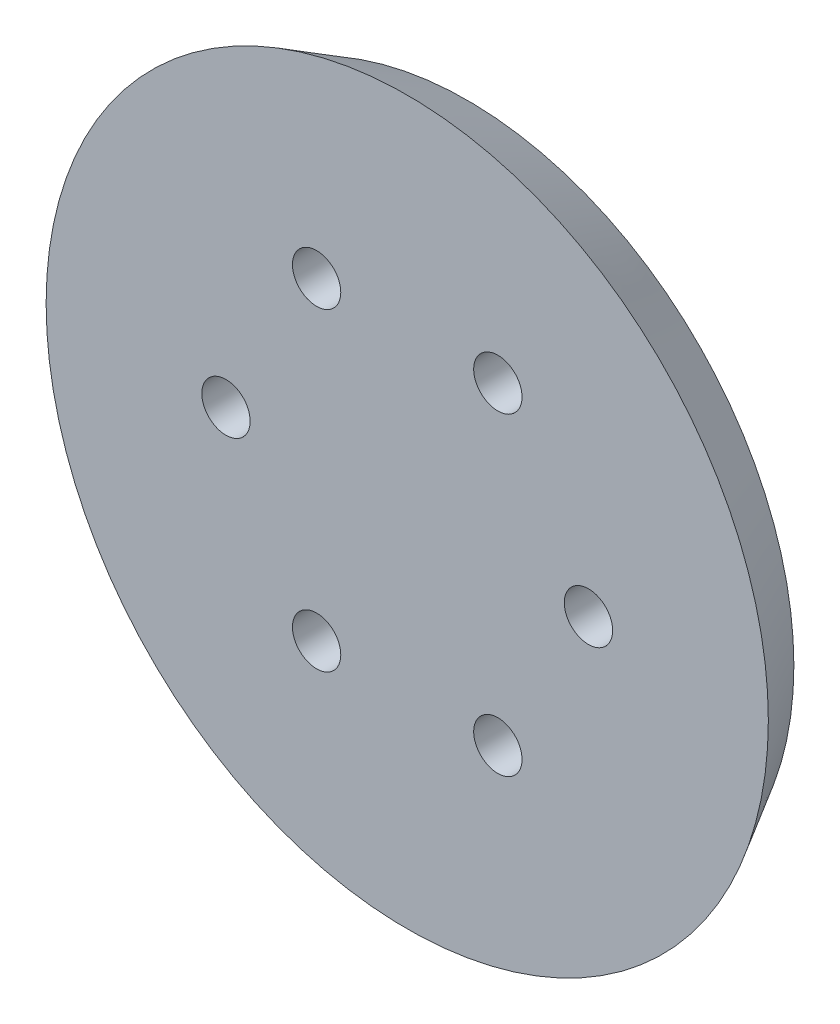
ISO-10303-21;
HEADER;
FILE_DESCRIPTION(('STEP AP214'),'2;1');
FILE_NAME('part.step','',(''),(''),'','','');
FILE_SCHEMA(('AUTOMOTIVE_DESIGN { 1 0 10303 214 1 1 1 1 }'));
ENDSEC;
DATA;
#1=APPLICATION_CONTEXT('core data for automotive mechanical design processes');
#2=APPLICATION_PROTOCOL_DEFINITION('international standard','automotive_design',2000,#1);
#3=PRODUCT_CONTEXT('',#1,'mechanical');
#4=PRODUCT('Part','Part','',(#3));
#5=PRODUCT_RELATED_PRODUCT_CATEGORY('part','',(#4));
#6=PRODUCT_DEFINITION_FORMATION('','',#4);
#7=PRODUCT_DEFINITION_CONTEXT('part definition',#1,'design');
#8=PRODUCT_DEFINITION('design','',#6,#7);
#9=PRODUCT_DEFINITION_SHAPE('','',#8);
#10=(LENGTH_UNIT() NAMED_UNIT(*) SI_UNIT(.MILLI.,.METRE.));
#11=(NAMED_UNIT(*) PLANE_ANGLE_UNIT() SI_UNIT($,.RADIAN.));
#12=(NAMED_UNIT(*) SI_UNIT($,.STERADIAN.) SOLID_ANGLE_UNIT());
#13=UNCERTAINTY_MEASURE_WITH_UNIT(LENGTH_MEASURE(1.E-05),#10,'distance_accuracy_value','');
#14=(GEOMETRIC_REPRESENTATION_CONTEXT(3) GLOBAL_UNCERTAINTY_ASSIGNED_CONTEXT((#13)) GLOBAL_UNIT_ASSIGNED_CONTEXT((#10,
#11,#12)) REPRESENTATION_CONTEXT('',''));
#15=CARTESIAN_POINT('',(0.,0.,0.));
#16=DIRECTION('',(0.,0.,1.));
#17=DIRECTION('',(1.,0.,0.));
#18=AXIS2_PLACEMENT_3D('',#15,#16,#17);
#19=CARTESIAN_POINT('',(0.,0.,-2.54));
#20=DIRECTION('',(0.,0.,-1.));
#21=DIRECTION('',(-1.,0.,0.));
#22=AXIS2_PLACEMENT_3D('',#19,#20,#21);
#23=PLANE('',#22);
#24=CARTESIAN_POINT('',(0.,0.,-2.54));
#25=DIRECTION('',(0.,0.,-1.));
#26=DIRECTION('',(-1.,0.,0.));
#27=AXIS2_PLACEMENT_3D('',#24,#25,#26);
#28=CIRCLE('',#27,5.08);
#29=CARTESIAN_POINT('',(-5.08,0.,-2.54));
#30=VERTEX_POINT('',#29);
#31=EDGE_CURVE('E83',#30,#30,#28,.T.);
#32=ORIENTED_EDGE('',*,*,#31,.T.);
#33=EDGE_LOOP('',(#32));
#34=FACE_BOUND('',#33,.T.);
#35=CARTESIAN_POINT('',(0.,0.,-2.54));
#36=DIRECTION('',(0.,0.,-1.));
#37=DIRECTION('',(-1.,0.,0.));
#38=AXIS2_PLACEMENT_3D('',#35,#36,#37);
#39=CIRCLE('',#38,4.064);
#40=CARTESIAN_POINT('',(-4.064,0.,-2.54));
#41=VERTEX_POINT('',#40);
#42=EDGE_CURVE('E89',#41,#41,#39,.T.);
#43=ORIENTED_EDGE('',*,*,#42,.F.);
#44=EDGE_LOOP('',(#43));
#45=FACE_BOUND('',#44,.T.);
#46=ADVANCED_FACE('F32',(#34,#45),#23,.T.);
#47=CARTESIAN_POINT('',(0.,0.,0.));
#48=DIRECTION('',(0.,0.,1.));
#49=DIRECTION('',(1.,0.,0.));
#50=AXIS2_PLACEMENT_3D('',#47,#48,#49);
#51=PLANE('',#50);
#52=CARTESIAN_POINT('',(19.0500000000004,32.9955678841869,0.));
#53=DIRECTION('',(0.,0.,1.));
#54=DIRECTION('',(1.,0.,0.));
#55=AXIS2_PLACEMENT_3D('',#52,#53,#54);
#56=CIRCLE('',#55,5.08);
#57=CARTESIAN_POINT('',(24.1300000000004,32.9955678841869,0.));
#58=VERTEX_POINT('',#57);
#59=EDGE_CURVE('E80',#58,#58,#56,.T.);
#60=ORIENTED_EDGE('',*,*,#59,.T.);
#61=EDGE_LOOP('',(#60));
#62=FACE_BOUND('',#61,.T.);
#63=CARTESIAN_POINT('',(-38.1,2.66050878019847E-13,0.));
#64=DIRECTION('',(0.,0.,1.));
#65=DIRECTION('',(1.,0.,0.));
#66=AXIS2_PLACEMENT_3D('',#63,#64,#65);
#67=CIRCLE('',#66,5.07999999999999);
#68=CARTESIAN_POINT('',(-33.02,2.66050878019847E-13,0.));
#69=VERTEX_POINT('',#68);
#70=EDGE_CURVE('E68',#69,#69,#67,.T.);
#71=ORIENTED_EDGE('',*,*,#70,.T.);
#72=EDGE_LOOP('',(#71));
#73=FACE_BOUND('',#72,.T.);
#74=CARTESIAN_POINT('',(19.0499999999999,-32.9955678841872,0.));
#75=DIRECTION('',(0.,0.,1.));
#76=DIRECTION('',(1.,0.,0.));
#77=AXIS2_PLACEMENT_3D('',#74,#75,#76);
#78=CIRCLE('',#77,5.08);
#79=CARTESIAN_POINT('',(24.1299999999999,-32.9955678841872,0.));
#80=VERTEX_POINT('',#79);
#81=EDGE_CURVE('E56',#80,#80,#78,.T.);
#82=ORIENTED_EDGE('',*,*,#81,.T.);
#83=EDGE_LOOP('',(#82));
#84=FACE_BOUND('',#83,.T.);
#85=CARTESIAN_POINT('',(38.1,0.,0.));
#86=DIRECTION('',(0.,0.,1.));
#87=DIRECTION('',(1.,0.,0.));
#88=AXIS2_PLACEMENT_3D('',#85,#86,#87);
#89=CIRCLE('',#88,5.08);
#90=CARTESIAN_POINT('',(43.18,0.,0.));
#91=VERTEX_POINT('',#90);
#92=EDGE_CURVE('E50',#91,#91,#89,.T.);
#93=ORIENTED_EDGE('',*,*,#92,.T.);
#94=EDGE_LOOP('',(#93));
#95=FACE_BOUND('',#94,.T.);
#96=CARTESIAN_POINT('',(-19.0500000000002,-32.995567884187,0.));
#97=DIRECTION('',(0.,0.,1.));
#98=DIRECTION('',(1.,0.,0.));
#99=AXIS2_PLACEMENT_3D('',#96,#97,#98);
#100=CIRCLE('',#99,5.08);
#101=CARTESIAN_POINT('',(-13.9700000000002,-32.995567884187,0.));
#102=VERTEX_POINT('',#101);
#103=EDGE_CURVE('E62',#102,#102,#100,.T.);
#104=ORIENTED_EDGE('',*,*,#103,.T.);
#105=EDGE_LOOP('',(#104));
#106=FACE_BOUND('',#105,.T.);
#107=CARTESIAN_POINT('',(-19.0499999999997,32.9955678841873,0.));
#108=DIRECTION('',(0.,0.,1.));
#109=DIRECTION('',(1.,0.,0.));
#110=AXIS2_PLACEMENT_3D('',#107,#108,#109);
#111=CIRCLE('',#110,5.08);
#112=CARTESIAN_POINT('',(-13.9699999999997,32.9955678841873,0.));
#113=VERTEX_POINT('',#112);
#114=EDGE_CURVE('E74',#113,#113,#111,.T.);
#115=ORIENTED_EDGE('',*,*,#114,.T.);
#116=EDGE_LOOP('',(#115));
#117=FACE_BOUND('',#116,.T.);
#118=CARTESIAN_POINT('',(0.,0.,0.));
#119=DIRECTION('',(0.,0.,1.));
#120=DIRECTION('',(1.,0.,0.));
#121=AXIS2_PLACEMENT_3D('',#118,#119,#120);
#122=CIRCLE('',#121,68.5799999999999);
#123=CARTESIAN_POINT('',(68.5799999999999,0.,0.));
#124=VERTEX_POINT('',#123);
#125=EDGE_CURVE('E39',#124,#124,#122,.F.);
#126=ORIENTED_EDGE('',*,*,#125,.T.);
#127=EDGE_LOOP('',(#126));
#128=FACE_BOUND('',#127,.T.);
#129=CARTESIAN_POINT('',(0.,0.,0.));
#130=DIRECTION('',(0.,0.,1.));
#131=DIRECTION('',(1.,0.,0.));
#132=AXIS2_PLACEMENT_3D('',#129,#130,#131);
#133=CIRCLE('',#132,5.08);
#134=CARTESIAN_POINT('',(5.08,0.,0.));
#135=VERTEX_POINT('',#134);
#136=EDGE_CURVE('E10',#135,#135,#133,.F.);
#137=ORIENTED_EDGE('',*,*,#136,.F.);
#138=EDGE_LOOP('',(#137));
#139=FACE_BOUND('',#138,.T.);
#140=ADVANCED_FACE('F123',(#62,#73,#84,#95,#106,#117,#128,#139),#51,.F.);
#141=CARTESIAN_POINT('',(0.,0.,12.7));
#142=DIRECTION('',(0.,0.,1.));
#143=DIRECTION('',(1.,0.,0.));
#144=AXIS2_PLACEMENT_3D('',#141,#142,#143);
#145=PLANE('',#144);
#146=CARTESIAN_POINT('',(0.,0.,12.7));
#147=DIRECTION('',(0.,0.,1.));
#148=DIRECTION('',(1.,0.,0.));
#149=AXIS2_PLACEMENT_3D('',#146,#147,#148);
#150=CIRCLE('',#149,75.9123484187081);
#151=CARTESIAN_POINT('',(75.9123484187081,0.,12.7));
#152=VERTEX_POINT('',#151);
#153=EDGE_CURVE('E43',#152,#152,#150,.T.);
#154=ORIENTED_EDGE('',*,*,#153,.T.);
#155=EDGE_LOOP('',(#154));
#156=FACE_BOUND('',#155,.T.);
#157=CARTESIAN_POINT('',(-19.0499999999997,32.9955678841873,12.7));
#158=DIRECTION('',(0.,0.,1.));
#159=DIRECTION('',(1.,0.,0.));
#160=AXIS2_PLACEMENT_3D('',#157,#158,#159);
#161=CIRCLE('',#160,5.08);
#162=CARTESIAN_POINT('',(-13.9699999999997,32.9955678841873,12.7));
#163=VERTEX_POINT('',#162);
#164=EDGE_CURVE('E71',#163,#163,#161,.T.);
#165=ORIENTED_EDGE('',*,*,#164,.F.);
#166=EDGE_LOOP('',(#165));
#167=FACE_BOUND('',#166,.T.);
#168=CARTESIAN_POINT('',(-19.0500000000002,-32.995567884187,12.7));
#169=DIRECTION('',(0.,0.,1.));
#170=DIRECTION('',(1.,0.,0.));
#171=AXIS2_PLACEMENT_3D('',#168,#169,#170);
#172=CIRCLE('',#171,5.08);
#173=CARTESIAN_POINT('',(-13.9700000000002,-32.995567884187,12.7));
#174=VERTEX_POINT('',#173);
#175=EDGE_CURVE('E59',#174,#174,#172,.T.);
#176=ORIENTED_EDGE('',*,*,#175,.F.);
#177=EDGE_LOOP('',(#176));
#178=FACE_BOUND('',#177,.T.);
#179=CARTESIAN_POINT('',(38.1,0.,12.7));
#180=DIRECTION('',(0.,0.,1.));
#181=DIRECTION('',(1.,0.,0.));
#182=AXIS2_PLACEMENT_3D('',#179,#180,#181);
#183=CIRCLE('',#182,5.08);
#184=CARTESIAN_POINT('',(43.18,0.,12.7));
#185=VERTEX_POINT('',#184);
#186=EDGE_CURVE('E47',#185,#185,#183,.T.);
#187=ORIENTED_EDGE('',*,*,#186,.F.);
#188=EDGE_LOOP('',(#187));
#189=FACE_BOUND('',#188,.T.);
#190=CARTESIAN_POINT('',(19.0499999999999,-32.9955678841872,12.7));
#191=DIRECTION('',(0.,0.,1.));
#192=DIRECTION('',(1.,0.,0.));
#193=AXIS2_PLACEMENT_3D('',#190,#191,#192);
#194=CIRCLE('',#193,5.08);
#195=CARTESIAN_POINT('',(24.1299999999999,-32.9955678841872,12.7));
#196=VERTEX_POINT('',#195);
#197=EDGE_CURVE('E53',#196,#196,#194,.T.);
#198=ORIENTED_EDGE('',*,*,#197,.F.);
#199=EDGE_LOOP('',(#198));
#200=FACE_BOUND('',#199,.T.);
#201=CARTESIAN_POINT('',(-38.1,2.66050878019847E-13,12.7));
#202=DIRECTION('',(0.,0.,1.));
#203=DIRECTION('',(1.,0.,0.));
#204=AXIS2_PLACEMENT_3D('',#201,#202,#203);
#205=CIRCLE('',#204,5.07999999999999);
#206=CARTESIAN_POINT('',(-33.02,2.66050878019847E-13,12.7));
#207=VERTEX_POINT('',#206);
#208=EDGE_CURVE('E65',#207,#207,#205,.T.);
#209=ORIENTED_EDGE('',*,*,#208,.F.);
#210=EDGE_LOOP('',(#209));
#211=FACE_BOUND('',#210,.T.);
#212=CARTESIAN_POINT('',(19.0500000000004,32.9955678841869,12.7));
#213=DIRECTION('',(0.,0.,1.));
#214=DIRECTION('',(1.,0.,0.));
#215=AXIS2_PLACEMENT_3D('',#212,#213,#214);
#216=CIRCLE('',#215,5.08);
#217=CARTESIAN_POINT('',(24.1300000000004,32.9955678841869,12.7));
#218=VERTEX_POINT('',#217);
#219=EDGE_CURVE('E77',#218,#218,#216,.T.);
#220=ORIENTED_EDGE('',*,*,#219,.F.);
#221=EDGE_LOOP('',(#220));
#222=FACE_BOUND('',#221,.T.);
#223=ADVANCED_FACE('F129',(#156,#167,#178,#189,#200,#211,#222),#145,.T.);
#224=CARTESIAN_POINT('',(38.1,0.,12.7));
#225=DIRECTION('',(0.,0.,-1.));
#226=DIRECTION('',(-1.,0.,0.));
#227=AXIS2_PLACEMENT_3D('',#224,#225,#226);
#228=CYLINDRICAL_SURFACE('',#227,5.08);
#229=ORIENTED_EDGE('',*,*,#186,.T.);
#230=EDGE_LOOP('',(#229));
#231=FACE_BOUND('',#230,.T.);
#232=ORIENTED_EDGE('',*,*,#92,.F.);
#233=EDGE_LOOP('',(#232));
#234=FACE_BOUND('',#233,.T.);
#235=ADVANCED_FACE('F154',(#231,#234),#228,.F.);
#236=CARTESIAN_POINT('',(19.0499999999999,-32.9955678841872,12.7));
#237=DIRECTION('',(0.,0.,-1.));
#238=DIRECTION('',(-1.,0.,0.));
#239=AXIS2_PLACEMENT_3D('',#236,#237,#238);
#240=CYLINDRICAL_SURFACE('',#239,5.08);
#241=ORIENTED_EDGE('',*,*,#197,.T.);
#242=EDGE_LOOP('',(#241));
#243=FACE_BOUND('',#242,.T.);
#244=ORIENTED_EDGE('',*,*,#81,.F.);
#245=EDGE_LOOP('',(#244));
#246=FACE_BOUND('',#245,.T.);
#247=ADVANCED_FACE('F150',(#243,#246),#240,.F.);
#248=CARTESIAN_POINT('',(-19.0500000000002,-32.995567884187,12.7));
#249=DIRECTION('',(0.,0.,-1.));
#250=DIRECTION('',(-1.,0.,0.));
#251=AXIS2_PLACEMENT_3D('',#248,#249,#250);
#252=CYLINDRICAL_SURFACE('',#251,5.08);
#253=ORIENTED_EDGE('',*,*,#175,.T.);
#254=EDGE_LOOP('',(#253));
#255=FACE_BOUND('',#254,.T.);
#256=ORIENTED_EDGE('',*,*,#103,.F.);
#257=EDGE_LOOP('',(#256));
#258=FACE_BOUND('',#257,.T.);
#259=ADVANCED_FACE('F146',(#255,#258),#252,.F.);
#260=CARTESIAN_POINT('',(-38.1,2.66050878019847E-13,12.7));
#261=DIRECTION('',(0.,0.,-1.));
#262=DIRECTION('',(-1.,0.,0.));
#263=AXIS2_PLACEMENT_3D('',#260,#261,#262);
#264=CYLINDRICAL_SURFACE('',#263,5.07999999999999);
#265=ORIENTED_EDGE('',*,*,#208,.T.);
#266=EDGE_LOOP('',(#265));
#267=FACE_BOUND('',#266,.T.);
#268=ORIENTED_EDGE('',*,*,#70,.F.);
#269=EDGE_LOOP('',(#268));
#270=FACE_BOUND('',#269,.T.);
#271=ADVANCED_FACE('F142',(#267,#270),#264,.F.);
#272=CARTESIAN_POINT('',(-19.0499999999997,32.9955678841873,12.7));
#273=DIRECTION('',(0.,0.,-1.));
#274=DIRECTION('',(-1.,0.,0.));
#275=AXIS2_PLACEMENT_3D('',#272,#273,#274);
#276=CYLINDRICAL_SURFACE('',#275,5.08);
#277=ORIENTED_EDGE('',*,*,#164,.T.);
#278=EDGE_LOOP('',(#277));
#279=FACE_BOUND('',#278,.T.);
#280=ORIENTED_EDGE('',*,*,#114,.F.);
#281=EDGE_LOOP('',(#280));
#282=FACE_BOUND('',#281,.T.);
#283=ADVANCED_FACE('F138',(#279,#282),#276,.F.);
#284=CARTESIAN_POINT('',(19.0500000000004,32.9955678841869,12.7));
#285=DIRECTION('',(0.,0.,-1.));
#286=DIRECTION('',(-1.,0.,0.));
#287=AXIS2_PLACEMENT_3D('',#284,#285,#286);
#288=CYLINDRICAL_SURFACE('',#287,5.08);
#289=ORIENTED_EDGE('',*,*,#219,.T.);
#290=EDGE_LOOP('',(#289));
#291=FACE_BOUND('',#290,.T.);
#292=ORIENTED_EDGE('',*,*,#59,.F.);
#293=EDGE_LOOP('',(#292));
#294=FACE_BOUND('',#293,.T.);
#295=ADVANCED_FACE('F135',(#291,#294),#288,.F.);
#296=CARTESIAN_POINT('',(0.,0.,13.1982271536751));
#297=DIRECTION('',(0.,0.,1.));
#298=DIRECTION('',(1.,0.,0.));
#299=AXIS2_PLACEMENT_3D('',#296,#297,#298);
#300=CONICAL_SURFACE('',#299,76.2,0.523598775598295);
#301=ORIENTED_EDGE('',*,*,#125,.F.);
#302=EDGE_LOOP('',(#301));
#303=FACE_BOUND('',#302,.T.);
#304=ORIENTED_EDGE('',*,*,#153,.F.);
#305=EDGE_LOOP('',(#304));
#306=FACE_BOUND('',#305,.T.);
#307=ADVANCED_FACE('F34',(#303,#306),#300,.T.);
#308=CARTESIAN_POINT('',(0.,0.,-2.54));
#309=DIRECTION('',(0.,0.,1.));
#310=DIRECTION('',(1.,0.,0.));
#311=AXIS2_PLACEMENT_3D('',#308,#309,#310);
#312=CYLINDRICAL_SURFACE('',#311,5.08);
#313=ORIENTED_EDGE('',*,*,#31,.F.);
#314=EDGE_LOOP('',(#313));
#315=FACE_BOUND('',#314,.T.);
#316=ORIENTED_EDGE('',*,*,#136,.T.);
#317=EDGE_LOOP('',(#316));
#318=FACE_BOUND('',#317,.T.);
#319=ADVANCED_FACE('F118',(#315,#318),#312,.T.);
#320=CARTESIAN_POINT('',(0.,0.,-3.81));
#321=DIRECTION('',(0.,0.,1.));
#322=DIRECTION('',(1.,0.,0.));
#323=AXIS2_PLACEMENT_3D('',#320,#321,#322);
#324=CYLINDRICAL_SURFACE('',#323,4.064);
#325=CARTESIAN_POINT('',(0.,0.,-3.81));
#326=DIRECTION('',(0.,0.,-1.));
#327=DIRECTION('',(-1.,0.,0.));
#328=AXIS2_PLACEMENT_3D('',#325,#326,#327);
#329=CIRCLE('',#328,4.064);
#330=CARTESIAN_POINT('',(-4.064,0.,-3.81));
#331=VERTEX_POINT('',#330);
#332=EDGE_CURVE('E88',#331,#331,#329,.T.);
#333=ORIENTED_EDGE('',*,*,#332,.F.);
#334=EDGE_LOOP('',(#333));
#335=FACE_BOUND('',#334,.T.);
#336=ORIENTED_EDGE('',*,*,#42,.T.);
#337=EDGE_LOOP('',(#336));
#338=FACE_BOUND('',#337,.T.);
#339=ADVANCED_FACE('F112',(#335,#338),#324,.T.);
#340=CARTESIAN_POINT('',(0.,0.,-3.81));
#341=DIRECTION('',(0.,0.,-1.));
#342=DIRECTION('',(-1.,0.,0.));
#343=AXIS2_PLACEMENT_3D('',#340,#341,#342);
#344=PLANE('',#343);
#345=CARTESIAN_POINT('',(0.,0.,-3.81));
#346=DIRECTION('',(0.,0.,-1.));
#347=DIRECTION('',(-1.,0.,0.));
#348=AXIS2_PLACEMENT_3D('',#345,#346,#347);
#349=CIRCLE('',#348,4.572);
#350=CARTESIAN_POINT('',(-4.572,0.,-3.81));
#351=VERTEX_POINT('',#350);
#352=EDGE_CURVE('E95',#351,#351,#349,.T.);
#353=ORIENTED_EDGE('',*,*,#352,.F.);
#354=EDGE_LOOP('',(#353));
#355=FACE_BOUND('',#354,.T.);
#356=ORIENTED_EDGE('',*,*,#332,.T.);
#357=EDGE_LOOP('',(#356));
#358=FACE_BOUND('',#357,.T.);
#359=ADVANCED_FACE('F106',(#355,#358),#344,.F.);
#360=CARTESIAN_POINT('',(0.,0.,-10.16));
#361=DIRECTION('',(0.,0.,1.));
#362=DIRECTION('',(1.,0.,0.));
#363=AXIS2_PLACEMENT_3D('',#360,#361,#362);
#364=CYLINDRICAL_SURFACE('',#363,4.572);
#365=CARTESIAN_POINT('',(0.,0.,-10.16));
#366=DIRECTION('',(0.,0.,-1.));
#367=DIRECTION('',(-1.,0.,0.));
#368=AXIS2_PLACEMENT_3D('',#365,#366,#367);
#369=CIRCLE('',#368,4.572);
#370=CARTESIAN_POINT('',(-4.572,0.,-10.16));
#371=VERTEX_POINT('',#370);
#372=EDGE_CURVE('E92',#371,#371,#369,.T.);
#373=ORIENTED_EDGE('',*,*,#372,.F.);
#374=EDGE_LOOP('',(#373));
#375=FACE_BOUND('',#374,.T.);
#376=ORIENTED_EDGE('',*,*,#352,.T.);
#377=EDGE_LOOP('',(#376));
#378=FACE_BOUND('',#377,.T.);
#379=ADVANCED_FACE('F103',(#375,#378),#364,.T.);
#380=CARTESIAN_POINT('',(0.,0.,-10.16));
#381=DIRECTION('',(0.,0.,-1.));
#382=DIRECTION('',(-1.,0.,0.));
#383=AXIS2_PLACEMENT_3D('',#380,#381,#382);
#384=PLANE('',#383);
#385=ORIENTED_EDGE('',*,*,#372,.T.);
#386=EDGE_LOOP('',(#385));
#387=FACE_BOUND('',#386,.T.);
#388=ADVANCED_FACE('F101',(#387),#384,.T.);
#389=CLOSED_SHELL('',(#46,#140,#223,#235,#247,#259,#271,#283,#295,#307,#319,#339,#359,#379,#388));
#390=MANIFOLD_SOLID_BREP('B2',#389);
#391=ADVANCED_BREP_SHAPE_REPRESENTATION('',(#18,#390),#14);
#392=SHAPE_DEFINITION_REPRESENTATION(#9,#391);
ENDSEC;
END-ISO-10303-21;
